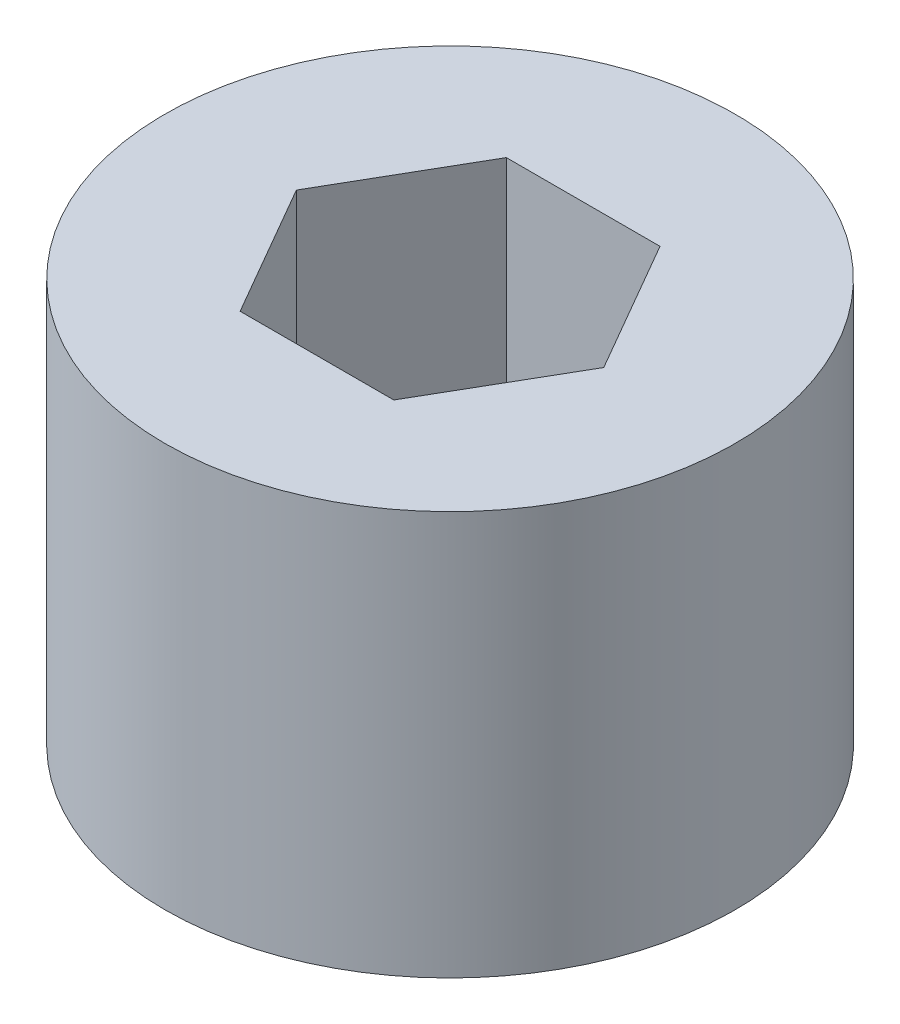
ISO-10303-21;
HEADER;
FILE_DESCRIPTION(('STEP AP214'),'2;1');
FILE_NAME('part.step','',(''),(''),'','','');
FILE_SCHEMA(('AUTOMOTIVE_DESIGN { 1 0 10303 214 1 1 1 1 }'));
ENDSEC;
DATA;
#1=APPLICATION_CONTEXT('core data for automotive mechanical design processes');
#2=APPLICATION_PROTOCOL_DEFINITION('international standard','automotive_design',2000,#1);
#3=PRODUCT_CONTEXT('',#1,'mechanical');
#4=PRODUCT('Part','Part','',(#3));
#5=PRODUCT_RELATED_PRODUCT_CATEGORY('part','',(#4));
#6=PRODUCT_DEFINITION_FORMATION('','',#4);
#7=PRODUCT_DEFINITION_CONTEXT('part definition',#1,'design');
#8=PRODUCT_DEFINITION('design','',#6,#7);
#9=PRODUCT_DEFINITION_SHAPE('','',#8);
#10=(LENGTH_UNIT() NAMED_UNIT(*) SI_UNIT(.MILLI.,.METRE.));
#11=(NAMED_UNIT(*) PLANE_ANGLE_UNIT() SI_UNIT($,.RADIAN.));
#12=(NAMED_UNIT(*) SI_UNIT($,.STERADIAN.) SOLID_ANGLE_UNIT());
#13=UNCERTAINTY_MEASURE_WITH_UNIT(LENGTH_MEASURE(1.E-05),#10,'distance_accuracy_value','');
#14=(GEOMETRIC_REPRESENTATION_CONTEXT(3) GLOBAL_UNCERTAINTY_ASSIGNED_CONTEXT((#13)) GLOBAL_UNIT_ASSIGNED_CONTEXT((#10,
#11,#12)) REPRESENTATION_CONTEXT('',''));
#15=CARTESIAN_POINT('',(0.,0.,0.));
#16=DIRECTION('',(0.,0.,1.));
#17=DIRECTION('',(1.,0.,0.));
#18=AXIS2_PLACEMENT_3D('',#15,#16,#17);
#19=CARTESIAN_POINT('',(0.,21.24,0.));
#20=DIRECTION('',(0.,1.,0.));
#21=DIRECTION('',(0.,0.,1.));
#22=AXIS2_PLACEMENT_3D('',#19,#20,#21);
#23=PLANE('',#22);
#24=CARTESIAN_POINT('',(0.,21.24,0.));
#25=DIRECTION('',(0.,1.,0.));
#26=DIRECTION('',(0.,0.,1.));
#27=AXIS2_PLACEMENT_3D('',#24,#25,#26);
#28=CIRCLE('',#27,15.);
#29=CARTESIAN_POINT('',(0.,21.24,15.));
#30=VERTEX_POINT('',#29);
#31=EDGE_CURVE('E96',#30,#30,#28,.T.);
#32=ORIENTED_EDGE('',*,*,#31,.T.);
#33=EDGE_LOOP('',(#32));
#34=FACE_BOUND('',#33,.T.);
#35=DIRECTION('',(0.5,0.,0.866025403784439));
#36=VECTOR('',#35,1.);
#37=CARTESIAN_POINT('',(6.06217782649107,21.24,-3.5));
#38=LINE('',#37,#36);
#39=CARTESIAN_POINT('',(4.04145188432738,21.24,-7.));
#40=VERTEX_POINT('',#39);
#41=CARTESIAN_POINT('',(8.08290376865476,21.24,0.));
#42=VERTEX_POINT('',#41);
#43=EDGE_CURVE('E144',#40,#42,#38,.T.);
#44=ORIENTED_EDGE('',*,*,#43,.T.);
#45=DIRECTION('',(-0.5,0.,0.866025403784439));
#46=VECTOR('',#45,1.);
#47=CARTESIAN_POINT('',(6.06217782649107,21.24,3.5));
#48=LINE('',#47,#46);
#49=CARTESIAN_POINT('',(4.04145188432738,21.24,7.));
#50=VERTEX_POINT('',#49);
#51=EDGE_CURVE('E129',#42,#50,#48,.T.);
#52=ORIENTED_EDGE('',*,*,#51,.T.);
#53=DIRECTION('',(-1.,0.,0.));
#54=VECTOR('',#53,1.);
#55=CARTESIAN_POINT('',(0.,21.24,7.));
#56=LINE('',#55,#54);
#57=CARTESIAN_POINT('',(-4.04145188432738,21.24,7.));
#58=VERTEX_POINT('',#57);
#59=EDGE_CURVE('E130',#50,#58,#56,.T.);
#60=ORIENTED_EDGE('',*,*,#59,.T.);
#61=DIRECTION('',(-0.5,0.,-0.866025403784439));
#62=VECTOR('',#61,1.);
#63=CARTESIAN_POINT('',(-6.06217782649108,21.24,3.5));
#64=LINE('',#63,#62);
#65=CARTESIAN_POINT('',(-8.08290376865477,21.24,0.));
#66=VERTEX_POINT('',#65);
#67=EDGE_CURVE('E103',#58,#66,#64,.T.);
#68=ORIENTED_EDGE('',*,*,#67,.T.);
#69=DIRECTION('',(0.5,0.,-0.866025403784439));
#70=VECTOR('',#69,1.);
#71=CARTESIAN_POINT('',(-6.06217782649107,21.24,-3.5));
#72=LINE('',#71,#70);
#73=CARTESIAN_POINT('',(-4.04145188432738,21.24,-7.));
#74=VERTEX_POINT('',#73);
#75=EDGE_CURVE('E138',#66,#74,#72,.T.);
#76=ORIENTED_EDGE('',*,*,#75,.T.);
#77=DIRECTION('',(1.,0.,0.));
#78=VECTOR('',#77,1.);
#79=CARTESIAN_POINT('',(0.,21.24,-7.));
#80=LINE('',#79,#78);
#81=EDGE_CURVE('E141',#74,#40,#80,.T.);
#82=ORIENTED_EDGE('',*,*,#81,.T.);
#83=EDGE_LOOP('',(#44,#52,#60,#68,#76,#82));
#84=FACE_BOUND('',#83,.T.);
#85=ADVANCED_FACE('F41',(#34,#84),#23,.T.);
#86=CARTESIAN_POINT('',(0.,0.,0.));
#87=DIRECTION('',(0.,1.,0.));
#88=DIRECTION('',(0.,0.,1.));
#89=AXIS2_PLACEMENT_3D('',#86,#87,#88);
#90=PLANE('',#89);
#91=CARTESIAN_POINT('',(0.,0.,0.));
#92=DIRECTION('',(0.,1.,0.));
#93=DIRECTION('',(0.,0.,1.));
#94=AXIS2_PLACEMENT_3D('',#91,#92,#93);
#95=CIRCLE('',#94,15.);
#96=CARTESIAN_POINT('',(0.,0.,15.));
#97=VERTEX_POINT('',#96);
#98=EDGE_CURVE('E147',#97,#97,#95,.T.);
#99=ORIENTED_EDGE('',*,*,#98,.F.);
#100=EDGE_LOOP('',(#99));
#101=FACE_BOUND('',#100,.T.);
#102=DIRECTION('',(-0.5,0.,0.866025403784439));
#103=VECTOR('',#102,1.);
#104=CARTESIAN_POINT('',(6.06217782649107,0.,3.5));
#105=LINE('',#104,#103);
#106=CARTESIAN_POINT('',(8.08290376865476,0.,0.));
#107=VERTEX_POINT('',#106);
#108=CARTESIAN_POINT('',(4.04145188432738,0.,7.));
#109=VERTEX_POINT('',#108);
#110=EDGE_CURVE('E11',#107,#109,#105,.T.);
#111=ORIENTED_EDGE('',*,*,#110,.F.);
#112=DIRECTION('',(0.5,0.,0.866025403784439));
#113=VECTOR('',#112,1.);
#114=CARTESIAN_POINT('',(6.06217782649107,0.,-3.5));
#115=LINE('',#114,#113);
#116=CARTESIAN_POINT('',(4.04145188432738,0.,-7.));
#117=VERTEX_POINT('',#116);
#118=EDGE_CURVE('E49',#117,#107,#115,.T.);
#119=ORIENTED_EDGE('',*,*,#118,.F.);
#120=DIRECTION('',(1.,0.,0.));
#121=VECTOR('',#120,1.);
#122=CARTESIAN_POINT('',(0.,0.,-7.));
#123=LINE('',#122,#121);
#124=CARTESIAN_POINT('',(-4.04145188432738,0.,-7.));
#125=VERTEX_POINT('',#124);
#126=EDGE_CURVE('E112',#125,#117,#123,.T.);
#127=ORIENTED_EDGE('',*,*,#126,.F.);
#128=DIRECTION('',(0.5,0.,-0.866025403784439));
#129=VECTOR('',#128,1.);
#130=CARTESIAN_POINT('',(-6.06217782649107,0.,-3.5));
#131=LINE('',#130,#129);
#132=CARTESIAN_POINT('',(-8.08290376865477,0.,0.));
#133=VERTEX_POINT('',#132);
#134=EDGE_CURVE('E110',#133,#125,#131,.T.);
#135=ORIENTED_EDGE('',*,*,#134,.F.);
#136=DIRECTION('',(-0.5,0.,-0.866025403784439));
#137=VECTOR('',#136,1.);
#138=CARTESIAN_POINT('',(-6.06217782649108,0.,3.5));
#139=LINE('',#138,#137);
#140=CARTESIAN_POINT('',(-4.04145188432738,0.,7.));
#141=VERTEX_POINT('',#140);
#142=EDGE_CURVE('E95',#141,#133,#139,.T.);
#143=ORIENTED_EDGE('',*,*,#142,.F.);
#144=DIRECTION('',(-1.,0.,0.));
#145=VECTOR('',#144,1.);
#146=CARTESIAN_POINT('',(0.,0.,7.));
#147=LINE('',#146,#145);
#148=EDGE_CURVE('E90',#109,#141,#147,.T.);
#149=ORIENTED_EDGE('',*,*,#148,.F.);
#150=EDGE_LOOP('',(#111,#119,#127,#135,#143,#149));
#151=FACE_BOUND('',#150,.T.);
#152=ADVANCED_FACE('F108',(#101,#151),#90,.F.);
#153=CARTESIAN_POINT('',(0.,21.24,0.));
#154=DIRECTION('',(0.,-1.,0.));
#155=DIRECTION('',(0.,0.,-1.));
#156=AXIS2_PLACEMENT_3D('',#153,#154,#155);
#157=CYLINDRICAL_SURFACE('',#156,15.);
#158=ORIENTED_EDGE('',*,*,#31,.F.);
#159=EDGE_LOOP('',(#158));
#160=FACE_BOUND('',#159,.T.);
#161=ORIENTED_EDGE('',*,*,#98,.T.);
#162=EDGE_LOOP('',(#161));
#163=FACE_BOUND('',#162,.T.);
#164=ADVANCED_FACE('F43',(#160,#163),#157,.T.);
#165=CARTESIAN_POINT('',(4.04145188432738,47.24,7.));
#166=DIRECTION('',(-0.866025403784439,0.,-0.5));
#167=DIRECTION('',(-0.5,0.,0.866025403784439));
#168=AXIS2_PLACEMENT_3D('',#165,#166,#167);
#169=PLANE('',#168);
#170=DIRECTION('',(0.,-1.,0.));
#171=VECTOR('',#170,1.);
#172=CARTESIAN_POINT('',(8.08290376865476,47.24,0.));
#173=LINE('',#172,#171);
#174=EDGE_CURVE('E122',#42,#107,#173,.T.);
#175=ORIENTED_EDGE('',*,*,#174,.T.);
#176=ORIENTED_EDGE('',*,*,#110,.T.);
#177=DIRECTION('',(0.,-1.,0.));
#178=VECTOR('',#177,1.);
#179=CARTESIAN_POINT('',(4.04145188432738,47.24,7.));
#180=LINE('',#179,#178);
#181=EDGE_CURVE('E61',#50,#109,#180,.T.);
#182=ORIENTED_EDGE('',*,*,#181,.F.);
#183=ORIENTED_EDGE('',*,*,#51,.F.);
#184=EDGE_LOOP('',(#175,#176,#182,#183));
#185=FACE_BOUND('',#184,.T.);
#186=ADVANCED_FACE('F127',(#185),#169,.T.);
#187=CARTESIAN_POINT('',(8.08290376865476,47.24,0.));
#188=DIRECTION('',(-0.866025403784439,0.,0.5));
#189=DIRECTION('',(0.5,0.,0.866025403784439));
#190=AXIS2_PLACEMENT_3D('',#187,#188,#189);
#191=PLANE('',#190);
#192=DIRECTION('',(0.,-1.,0.));
#193=VECTOR('',#192,1.);
#194=CARTESIAN_POINT('',(4.04145188432738,47.24,-7.));
#195=LINE('',#194,#193);
#196=EDGE_CURVE('E125',#40,#117,#195,.T.);
#197=ORIENTED_EDGE('',*,*,#196,.T.);
#198=ORIENTED_EDGE('',*,*,#118,.T.);
#199=ORIENTED_EDGE('',*,*,#174,.F.);
#200=ORIENTED_EDGE('',*,*,#43,.F.);
#201=EDGE_LOOP('',(#197,#198,#199,#200));
#202=FACE_BOUND('',#201,.T.);
#203=ADVANCED_FACE('F121',(#202),#191,.T.);
#204=CARTESIAN_POINT('',(4.04145188432738,47.24,-7.));
#205=DIRECTION('',(0.,0.,1.));
#206=DIRECTION('',(1.,0.,0.));
#207=AXIS2_PLACEMENT_3D('',#204,#205,#206);
#208=PLANE('',#207);
#209=DIRECTION('',(0.,-1.,0.));
#210=VECTOR('',#209,1.);
#211=CARTESIAN_POINT('',(-4.04145188432738,47.24,-7.));
#212=LINE('',#211,#210);
#213=EDGE_CURVE('E133',#74,#125,#212,.T.);
#214=ORIENTED_EDGE('',*,*,#213,.T.);
#215=ORIENTED_EDGE('',*,*,#126,.T.);
#216=ORIENTED_EDGE('',*,*,#196,.F.);
#217=ORIENTED_EDGE('',*,*,#81,.F.);
#218=EDGE_LOOP('',(#214,#215,#216,#217));
#219=FACE_BOUND('',#218,.T.);
#220=ADVANCED_FACE('F166',(#219),#208,.T.);
#221=CARTESIAN_POINT('',(-4.04145188432738,47.24,-7.));
#222=DIRECTION('',(0.866025403784439,0.,0.5));
#223=DIRECTION('',(0.5,0.,-0.866025403784439));
#224=AXIS2_PLACEMENT_3D('',#221,#222,#223);
#225=PLANE('',#224);
#226=DIRECTION('',(0.,-1.,0.));
#227=VECTOR('',#226,1.);
#228=CARTESIAN_POINT('',(-8.08290376865477,47.24,0.));
#229=LINE('',#228,#227);
#230=EDGE_CURVE('E105',#66,#133,#229,.T.);
#231=ORIENTED_EDGE('',*,*,#230,.T.);
#232=ORIENTED_EDGE('',*,*,#134,.T.);
#233=ORIENTED_EDGE('',*,*,#213,.F.);
#234=ORIENTED_EDGE('',*,*,#75,.F.);
#235=EDGE_LOOP('',(#231,#232,#233,#234));
#236=FACE_BOUND('',#235,.T.);
#237=ADVANCED_FACE('F169',(#236),#225,.T.);
#238=CARTESIAN_POINT('',(-8.08290376865477,47.24,0.));
#239=DIRECTION('',(0.866025403784439,0.,-0.5));
#240=DIRECTION('',(-0.5,0.,-0.866025403784439));
#241=AXIS2_PLACEMENT_3D('',#238,#239,#240);
#242=PLANE('',#241);
#243=DIRECTION('',(0.,-1.,0.));
#244=VECTOR('',#243,1.);
#245=CARTESIAN_POINT('',(-4.04145188432738,47.24,7.));
#246=LINE('',#245,#244);
#247=EDGE_CURVE('E56',#58,#141,#246,.T.);
#248=ORIENTED_EDGE('',*,*,#247,.T.);
#249=ORIENTED_EDGE('',*,*,#142,.T.);
#250=ORIENTED_EDGE('',*,*,#230,.F.);
#251=ORIENTED_EDGE('',*,*,#67,.F.);
#252=EDGE_LOOP('',(#248,#249,#250,#251));
#253=FACE_BOUND('',#252,.T.);
#254=ADVANCED_FACE('F99',(#253),#242,.T.);
#255=CARTESIAN_POINT('',(-4.04145188432738,47.24,7.));
#256=DIRECTION('',(0.,0.,-1.));
#257=DIRECTION('',(-1.,0.,0.));
#258=AXIS2_PLACEMENT_3D('',#255,#256,#257);
#259=PLANE('',#258);
#260=ORIENTED_EDGE('',*,*,#181,.T.);
#261=ORIENTED_EDGE('',*,*,#148,.T.);
#262=ORIENTED_EDGE('',*,*,#247,.F.);
#263=ORIENTED_EDGE('',*,*,#59,.F.);
#264=EDGE_LOOP('',(#260,#261,#262,#263));
#265=FACE_BOUND('',#264,.T.);
#266=ADVANCED_FACE('F91',(#265),#259,.T.);
#267=CLOSED_SHELL('',(#85,#152,#164,#186,#203,#220,#237,#254,#266));
#268=MANIFOLD_SOLID_BREP('B2',#267);
#269=ADVANCED_BREP_SHAPE_REPRESENTATION('',(#18,#268),#14);
#270=SHAPE_DEFINITION_REPRESENTATION(#9,#269);
ENDSEC;
END-ISO-10303-21;
